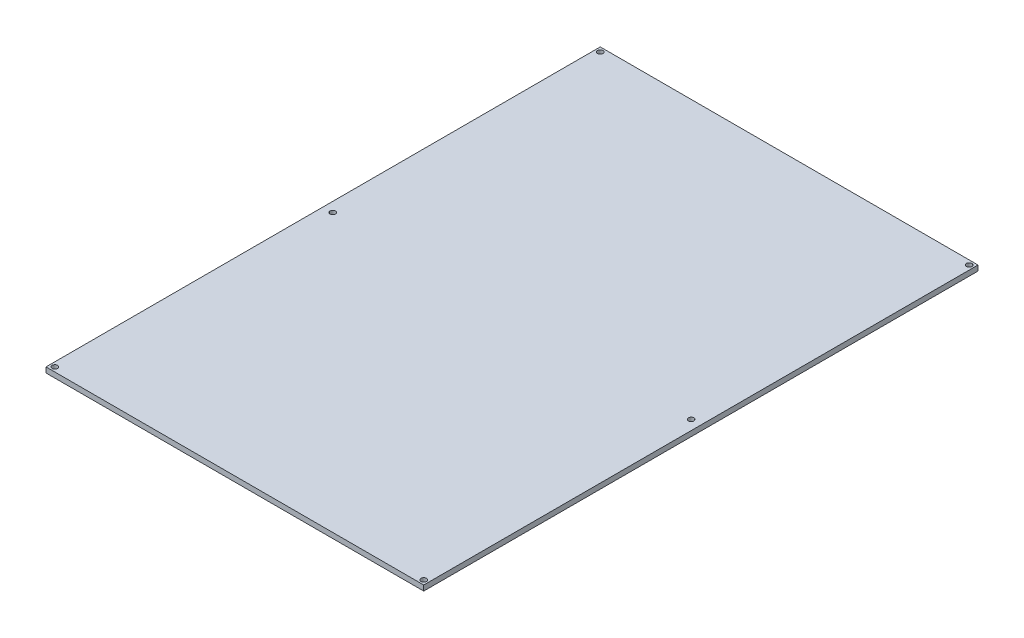
ISO-10303-21;
HEADER;
FILE_DESCRIPTION(('STEP AP214'),'2;1');
FILE_NAME('part.step','',(''),(''),'','','');
FILE_SCHEMA(('AUTOMOTIVE_DESIGN { 1 0 10303 214 1 1 1 1 }'));
ENDSEC;
DATA;
#1=APPLICATION_CONTEXT('core data for automotive mechanical design processes');
#2=APPLICATION_PROTOCOL_DEFINITION('international standard','automotive_design',2000,#1);
#3=PRODUCT_CONTEXT('',#1,'mechanical');
#4=PRODUCT('Part','Part','',(#3));
#5=PRODUCT_RELATED_PRODUCT_CATEGORY('part','',(#4));
#6=PRODUCT_DEFINITION_FORMATION('','',#4);
#7=PRODUCT_DEFINITION_CONTEXT('part definition',#1,'design');
#8=PRODUCT_DEFINITION('design','',#6,#7);
#9=PRODUCT_DEFINITION_SHAPE('','',#8);
#10=(LENGTH_UNIT() NAMED_UNIT(*) SI_UNIT(.MILLI.,.METRE.));
#11=(NAMED_UNIT(*) PLANE_ANGLE_UNIT() SI_UNIT($,.RADIAN.));
#12=(NAMED_UNIT(*) SI_UNIT($,.STERADIAN.) SOLID_ANGLE_UNIT());
#13=UNCERTAINTY_MEASURE_WITH_UNIT(LENGTH_MEASURE(1.E-05),#10,'distance_accuracy_value','');
#14=(GEOMETRIC_REPRESENTATION_CONTEXT(3) GLOBAL_UNCERTAINTY_ASSIGNED_CONTEXT((#13)) GLOBAL_UNIT_ASSIGNED_CONTEXT((#10,
#11,#12)) REPRESENTATION_CONTEXT('',''));
#15=CARTESIAN_POINT('',(0.,0.,0.));
#16=DIRECTION('',(0.,0.,1.));
#17=DIRECTION('',(1.,0.,0.));
#18=AXIS2_PLACEMENT_3D('',#15,#16,#17);
#19=CARTESIAN_POINT('',(0.,3.,0.));
#20=DIRECTION('',(0.,-1.,0.));
#21=DIRECTION('',(0.,0.,-1.));
#22=AXIS2_PLACEMENT_3D('',#19,#20,#21);
#23=PLANE('',#22);
#24=DIRECTION('',(0.,0.,1.));
#25=VECTOR('',#24,1.);
#26=CARTESIAN_POINT('',(0.,3.,0.));
#27=LINE('',#26,#25);
#28=CARTESIAN_POINT('',(-1.11022302462516E-13,3.,-314.));
#29=VERTEX_POINT('',#28);
#30=CARTESIAN_POINT('',(0.,3.,0.));
#31=VERTEX_POINT('',#30);
#32=EDGE_CURVE('E94',#29,#31,#27,.T.);
#33=ORIENTED_EDGE('',*,*,#32,.T.);
#34=DIRECTION('',(1.,0.,0.));
#35=VECTOR('',#34,1.);
#36=CARTESIAN_POINT('',(0.,3.,0.));
#37=LINE('',#36,#35);
#38=CARTESIAN_POINT('',(214.,3.,0.));
#39=VERTEX_POINT('',#38);
#40=EDGE_CURVE('E88',#31,#39,#37,.T.);
#41=ORIENTED_EDGE('',*,*,#40,.T.);
#42=DIRECTION('',(0.,0.,-1.));
#43=VECTOR('',#42,1.);
#44=CARTESIAN_POINT('',(214.,3.,0.));
#45=LINE('',#44,#43);
#46=CARTESIAN_POINT('',(214.,3.,-314.));
#47=VERTEX_POINT('',#46);
#48=EDGE_CURVE('E92',#39,#47,#45,.T.);
#49=ORIENTED_EDGE('',*,*,#48,.T.);
#50=DIRECTION('',(-1.,0.,0.));
#51=VECTOR('',#50,1.);
#52=CARTESIAN_POINT('',(-1.11022302462516E-13,3.,-314.));
#53=LINE('',#52,#51);
#54=EDGE_CURVE('E57',#47,#29,#53,.T.);
#55=ORIENTED_EDGE('',*,*,#54,.T.);
#56=EDGE_LOOP('',(#33,#41,#49,#55));
#57=FACE_BOUND('',#56,.T.);
#58=CARTESIAN_POINT('',(2.5,3.,-311.5));
#59=DIRECTION('',(0.,1.,0.));
#60=DIRECTION('',(0.,0.,1.));
#61=AXIS2_PLACEMENT_3D('',#58,#59,#60);
#62=CIRCLE('',#61,1.55000000000003);
#63=CARTESIAN_POINT('',(2.5,3.,-309.95));
#64=VERTEX_POINT('',#63);
#65=EDGE_CURVE('E114',#64,#64,#62,.T.);
#66=ORIENTED_EDGE('',*,*,#65,.F.);
#67=EDGE_LOOP('',(#66));
#68=FACE_BOUND('',#67,.T.);
#69=CARTESIAN_POINT('',(211.5,3.,-311.5));
#70=DIRECTION('',(0.,1.,0.));
#71=DIRECTION('',(0.,0.,-1.));
#72=AXIS2_PLACEMENT_3D('',#69,#70,#71);
#73=CIRCLE('',#72,1.55);
#74=CARTESIAN_POINT('',(211.5,3.,-313.05));
#75=VERTEX_POINT('',#74);
#76=EDGE_CURVE('E130',#75,#75,#73,.T.);
#77=ORIENTED_EDGE('',*,*,#76,.F.);
#78=EDGE_LOOP('',(#77));
#79=FACE_BOUND('',#78,.T.);
#80=CARTESIAN_POINT('',(2.50000000000009,3.,-2.49999999999998));
#81=DIRECTION('',(0.,1.,0.));
#82=DIRECTION('',(0.,0.,-1.));
#83=AXIS2_PLACEMENT_3D('',#80,#81,#82);
#84=CIRCLE('',#83,1.55000000000001);
#85=CARTESIAN_POINT('',(2.50000000000009,3.,-4.04999999999998));
#86=VERTEX_POINT('',#85);
#87=EDGE_CURVE('E136',#86,#86,#84,.T.);
#88=ORIENTED_EDGE('',*,*,#87,.F.);
#89=EDGE_LOOP('',(#88));
#90=FACE_BOUND('',#89,.T.);
#91=CARTESIAN_POINT('',(211.5,3.,-2.5));
#92=DIRECTION('',(0.,1.,0.));
#93=DIRECTION('',(0.,0.,1.));
#94=AXIS2_PLACEMENT_3D('',#91,#92,#93);
#95=CIRCLE('',#94,1.54999999999999);
#96=CARTESIAN_POINT('',(211.5,3.,-0.950000000000008));
#97=VERTEX_POINT('',#96);
#98=EDGE_CURVE('E142',#97,#97,#95,.T.);
#99=ORIENTED_EDGE('',*,*,#98,.F.);
#100=EDGE_LOOP('',(#99));
#101=FACE_BOUND('',#100,.T.);
#102=CARTESIAN_POINT('',(5.50000000000003,3.,-157.));
#103=DIRECTION('',(0.,1.,0.));
#104=DIRECTION('',(0.,0.,1.));
#105=AXIS2_PLACEMENT_3D('',#102,#103,#104);
#106=CIRCLE('',#105,1.55);
#107=CARTESIAN_POINT('',(5.50000000000003,3.,-155.45));
#108=VERTEX_POINT('',#107);
#109=EDGE_CURVE('E148',#108,#108,#106,.T.);
#110=ORIENTED_EDGE('',*,*,#109,.F.);
#111=EDGE_LOOP('',(#110));
#112=FACE_BOUND('',#111,.T.);
#113=CARTESIAN_POINT('',(208.5,3.,-157.));
#114=DIRECTION('',(0.,1.,0.));
#115=DIRECTION('',(0.,0.,-1.));
#116=AXIS2_PLACEMENT_3D('',#113,#114,#115);
#117=CIRCLE('',#116,1.54999999999999);
#118=CARTESIAN_POINT('',(208.5,3.,-158.55));
#119=VERTEX_POINT('',#118);
#120=EDGE_CURVE('E155',#119,#119,#117,.T.);
#121=ORIENTED_EDGE('',*,*,#120,.F.);
#122=EDGE_LOOP('',(#121));
#123=FACE_BOUND('',#122,.T.);
#124=ADVANCED_FACE('F40',(#57,#68,#79,#90,#101,#112,#123),#23,.F.);
#125=CARTESIAN_POINT('',(0.,0.,0.));
#126=DIRECTION('',(0.,-1.,0.));
#127=DIRECTION('',(0.,0.,-1.));
#128=AXIS2_PLACEMENT_3D('',#125,#126,#127);
#129=PLANE('',#128);
#130=CARTESIAN_POINT('',(5.50000000000003,0.,-157.));
#131=DIRECTION('',(0.,1.,0.));
#132=DIRECTION('',(0.,0.,1.));
#133=AXIS2_PLACEMENT_3D('',#130,#131,#132);
#134=CIRCLE('',#133,1.55);
#135=CARTESIAN_POINT('',(5.50000000000003,0.,-155.45));
#136=VERTEX_POINT('',#135);
#137=EDGE_CURVE('E152',#136,#136,#134,.T.);
#138=ORIENTED_EDGE('',*,*,#137,.T.);
#139=EDGE_LOOP('',(#138));
#140=FACE_BOUND('',#139,.T.);
#141=CARTESIAN_POINT('',(2.50000000000009,0.,-2.49999999999998));
#142=DIRECTION('',(0.,1.,0.));
#143=DIRECTION('',(0.,0.,-1.));
#144=AXIS2_PLACEMENT_3D('',#141,#142,#143);
#145=CIRCLE('',#144,1.55000000000001);
#146=CARTESIAN_POINT('',(2.50000000000009,0.,-4.04999999999998));
#147=VERTEX_POINT('',#146);
#148=EDGE_CURVE('E139',#147,#147,#145,.T.);
#149=ORIENTED_EDGE('',*,*,#148,.T.);
#150=EDGE_LOOP('',(#149));
#151=FACE_BOUND('',#150,.T.);
#152=CARTESIAN_POINT('',(2.5,0.,-311.5));
#153=DIRECTION('',(0.,1.,0.));
#154=DIRECTION('',(0.,0.,1.));
#155=AXIS2_PLACEMENT_3D('',#152,#153,#154);
#156=CIRCLE('',#155,1.55000000000003);
#157=CARTESIAN_POINT('',(2.5,0.,-309.95));
#158=VERTEX_POINT('',#157);
#159=EDGE_CURVE('E127',#158,#158,#156,.T.);
#160=ORIENTED_EDGE('',*,*,#159,.T.);
#161=EDGE_LOOP('',(#160));
#162=FACE_BOUND('',#161,.T.);
#163=DIRECTION('',(0.,0.,1.));
#164=VECTOR('',#163,1.);
#165=CARTESIAN_POINT('',(0.,0.,0.));
#166=LINE('',#165,#164);
#167=CARTESIAN_POINT('',(-1.11022302462516E-13,0.,-314.));
#168=VERTEX_POINT('',#167);
#169=CARTESIAN_POINT('',(0.,0.,0.));
#170=VERTEX_POINT('',#169);
#171=EDGE_CURVE('E111',#168,#170,#166,.T.);
#172=ORIENTED_EDGE('',*,*,#171,.F.);
#173=DIRECTION('',(-1.,0.,0.));
#174=VECTOR('',#173,1.);
#175=CARTESIAN_POINT('',(-1.11022302462516E-13,0.,-314.));
#176=LINE('',#175,#174);
#177=CARTESIAN_POINT('',(214.,0.,-314.));
#178=VERTEX_POINT('',#177);
#179=EDGE_CURVE('E81',#178,#168,#176,.T.);
#180=ORIENTED_EDGE('',*,*,#179,.F.);
#181=DIRECTION('',(0.,0.,-1.));
#182=VECTOR('',#181,1.);
#183=CARTESIAN_POINT('',(214.,0.,0.));
#184=LINE('',#183,#182);
#185=CARTESIAN_POINT('',(214.,0.,0.));
#186=VERTEX_POINT('',#185);
#187=EDGE_CURVE('E75',#186,#178,#184,.T.);
#188=ORIENTED_EDGE('',*,*,#187,.F.);
#189=DIRECTION('',(1.,0.,0.));
#190=VECTOR('',#189,1.);
#191=CARTESIAN_POINT('',(0.,0.,0.));
#192=LINE('',#191,#190);
#193=EDGE_CURVE('E99',#170,#186,#192,.T.);
#194=ORIENTED_EDGE('',*,*,#193,.F.);
#195=EDGE_LOOP('',(#172,#180,#188,#194));
#196=FACE_BOUND('',#195,.T.);
#197=CARTESIAN_POINT('',(211.5,0.,-311.5));
#198=DIRECTION('',(0.,1.,0.));
#199=DIRECTION('',(0.,0.,-1.));
#200=AXIS2_PLACEMENT_3D('',#197,#198,#199);
#201=CIRCLE('',#200,1.55);
#202=CARTESIAN_POINT('',(211.5,0.,-313.05));
#203=VERTEX_POINT('',#202);
#204=EDGE_CURVE('E133',#203,#203,#201,.T.);
#205=ORIENTED_EDGE('',*,*,#204,.T.);
#206=EDGE_LOOP('',(#205));
#207=FACE_BOUND('',#206,.T.);
#208=CARTESIAN_POINT('',(211.5,0.,-2.5));
#209=DIRECTION('',(0.,1.,0.));
#210=DIRECTION('',(0.,0.,1.));
#211=AXIS2_PLACEMENT_3D('',#208,#209,#210);
#212=CIRCLE('',#211,1.54999999999999);
#213=CARTESIAN_POINT('',(211.5,0.,-0.950000000000008));
#214=VERTEX_POINT('',#213);
#215=EDGE_CURVE('E145',#214,#214,#212,.T.);
#216=ORIENTED_EDGE('',*,*,#215,.T.);
#217=EDGE_LOOP('',(#216));
#218=FACE_BOUND('',#217,.T.);
#219=CARTESIAN_POINT('',(208.5,0.,-157.));
#220=DIRECTION('',(0.,1.,0.));
#221=DIRECTION('',(0.,0.,-1.));
#222=AXIS2_PLACEMENT_3D('',#219,#220,#221);
#223=CIRCLE('',#222,1.54999999999999);
#224=CARTESIAN_POINT('',(208.5,0.,-158.55));
#225=VERTEX_POINT('',#224);
#226=EDGE_CURVE('E158',#225,#225,#223,.T.);
#227=ORIENTED_EDGE('',*,*,#226,.T.);
#228=EDGE_LOOP('',(#227));
#229=FACE_BOUND('',#228,.T.);
#230=ADVANCED_FACE('F123',(#140,#151,#162,#196,#207,#218,#229),#129,.T.);
#231=CARTESIAN_POINT('',(0.,3.,0.));
#232=DIRECTION('',(1.,0.,0.));
#233=DIRECTION('',(0.,0.,-1.));
#234=AXIS2_PLACEMENT_3D('',#231,#232,#233);
#235=PLANE('',#234);
#236=ORIENTED_EDGE('',*,*,#171,.T.);
#237=DIRECTION('',(0.,-1.,0.));
#238=VECTOR('',#237,1.);
#239=CARTESIAN_POINT('',(0.,3.,0.));
#240=LINE('',#239,#238);
#241=EDGE_CURVE('E11',#31,#170,#240,.T.);
#242=ORIENTED_EDGE('',*,*,#241,.F.);
#243=ORIENTED_EDGE('',*,*,#32,.F.);
#244=DIRECTION('',(0.,-1.,0.));
#245=VECTOR('',#244,1.);
#246=CARTESIAN_POINT('',(-1.11022302462516E-13,3.,-314.));
#247=LINE('',#246,#245);
#248=EDGE_CURVE('E107',#29,#168,#247,.T.);
#249=ORIENTED_EDGE('',*,*,#248,.T.);
#250=EDGE_LOOP('',(#236,#242,#243,#249));
#251=FACE_BOUND('',#250,.T.);
#252=ADVANCED_FACE('F42',(#251),#235,.F.);
#253=CARTESIAN_POINT('',(0.,3.,0.));
#254=DIRECTION('',(0.,0.,-1.));
#255=DIRECTION('',(-1.,0.,0.));
#256=AXIS2_PLACEMENT_3D('',#253,#254,#255);
#257=PLANE('',#256);
#258=ORIENTED_EDGE('',*,*,#193,.T.);
#259=DIRECTION('',(0.,-1.,0.));
#260=VECTOR('',#259,1.);
#261=CARTESIAN_POINT('',(214.,3.,0.));
#262=LINE('',#261,#260);
#263=EDGE_CURVE('E49',#39,#186,#262,.T.);
#264=ORIENTED_EDGE('',*,*,#263,.F.);
#265=ORIENTED_EDGE('',*,*,#40,.F.);
#266=ORIENTED_EDGE('',*,*,#241,.T.);
#267=EDGE_LOOP('',(#258,#264,#265,#266));
#268=FACE_BOUND('',#267,.T.);
#269=ADVANCED_FACE('F98',(#268),#257,.F.);
#270=CARTESIAN_POINT('',(214.,3.,0.));
#271=DIRECTION('',(-1.,0.,0.));
#272=DIRECTION('',(0.,0.,1.));
#273=AXIS2_PLACEMENT_3D('',#270,#271,#272);
#274=PLANE('',#273);
#275=ORIENTED_EDGE('',*,*,#187,.T.);
#276=DIRECTION('',(0.,-1.,0.));
#277=VECTOR('',#276,1.);
#278=CARTESIAN_POINT('',(214.,3.,-314.));
#279=LINE('',#278,#277);
#280=EDGE_CURVE('E101',#47,#178,#279,.T.);
#281=ORIENTED_EDGE('',*,*,#280,.F.);
#282=ORIENTED_EDGE('',*,*,#48,.F.);
#283=ORIENTED_EDGE('',*,*,#263,.T.);
#284=EDGE_LOOP('',(#275,#281,#282,#283));
#285=FACE_BOUND('',#284,.T.);
#286=ADVANCED_FACE('F102',(#285),#274,.F.);
#287=CARTESIAN_POINT('',(-1.11022302462516E-13,3.,-314.));
#288=DIRECTION('',(0.,0.,1.));
#289=DIRECTION('',(1.,0.,0.));
#290=AXIS2_PLACEMENT_3D('',#287,#288,#289);
#291=PLANE('',#290);
#292=ORIENTED_EDGE('',*,*,#179,.T.);
#293=ORIENTED_EDGE('',*,*,#248,.F.);
#294=ORIENTED_EDGE('',*,*,#54,.F.);
#295=ORIENTED_EDGE('',*,*,#280,.T.);
#296=EDGE_LOOP('',(#292,#293,#294,#295));
#297=FACE_BOUND('',#296,.T.);
#298=ADVANCED_FACE('F120',(#297),#291,.F.);
#299=CARTESIAN_POINT('',(2.5,3.,-311.5));
#300=DIRECTION('',(0.,-1.,0.));
#301=DIRECTION('',(0.,0.,-1.));
#302=AXIS2_PLACEMENT_3D('',#299,#300,#301);
#303=CYLINDRICAL_SURFACE('',#302,1.55000000000003);
#304=ORIENTED_EDGE('',*,*,#65,.T.);
#305=EDGE_LOOP('',(#304));
#306=FACE_BOUND('',#305,.T.);
#307=ORIENTED_EDGE('',*,*,#159,.F.);
#308=EDGE_LOOP('',(#307));
#309=FACE_BOUND('',#308,.T.);
#310=ADVANCED_FACE('F177',(#306,#309),#303,.F.);
#311=CARTESIAN_POINT('',(211.5,3.,-311.5));
#312=DIRECTION('',(0.,-1.,0.));
#313=DIRECTION('',(0.,0.,-1.));
#314=AXIS2_PLACEMENT_3D('',#311,#312,#313);
#315=CYLINDRICAL_SURFACE('',#314,1.55);
#316=ORIENTED_EDGE('',*,*,#76,.T.);
#317=EDGE_LOOP('',(#316));
#318=FACE_BOUND('',#317,.T.);
#319=ORIENTED_EDGE('',*,*,#204,.F.);
#320=EDGE_LOOP('',(#319));
#321=FACE_BOUND('',#320,.T.);
#322=ADVANCED_FACE('F225',(#318,#321),#315,.F.);
#323=CARTESIAN_POINT('',(2.50000000000009,3.,-2.49999999999998));
#324=DIRECTION('',(0.,-1.,0.));
#325=DIRECTION('',(0.,0.,-1.));
#326=AXIS2_PLACEMENT_3D('',#323,#324,#325);
#327=CYLINDRICAL_SURFACE('',#326,1.55000000000001);
#328=ORIENTED_EDGE('',*,*,#87,.T.);
#329=EDGE_LOOP('',(#328));
#330=FACE_BOUND('',#329,.T.);
#331=ORIENTED_EDGE('',*,*,#148,.F.);
#332=EDGE_LOOP('',(#331));
#333=FACE_BOUND('',#332,.T.);
#334=ADVANCED_FACE('F233',(#330,#333),#327,.F.);
#335=CARTESIAN_POINT('',(211.5,3.,-2.5));
#336=DIRECTION('',(0.,-1.,0.));
#337=DIRECTION('',(0.,0.,-1.));
#338=AXIS2_PLACEMENT_3D('',#335,#336,#337);
#339=CYLINDRICAL_SURFACE('',#338,1.54999999999999);
#340=ORIENTED_EDGE('',*,*,#98,.T.);
#341=EDGE_LOOP('',(#340));
#342=FACE_BOUND('',#341,.T.);
#343=ORIENTED_EDGE('',*,*,#215,.F.);
#344=EDGE_LOOP('',(#343));
#345=FACE_BOUND('',#344,.T.);
#346=ADVANCED_FACE('F241',(#342,#345),#339,.F.);
#347=CARTESIAN_POINT('',(5.50000000000003,3.,-157.));
#348=DIRECTION('',(0.,-1.,0.));
#349=DIRECTION('',(0.,0.,-1.));
#350=AXIS2_PLACEMENT_3D('',#347,#348,#349);
#351=CYLINDRICAL_SURFACE('',#350,1.55);
#352=ORIENTED_EDGE('',*,*,#109,.T.);
#353=EDGE_LOOP('',(#352));
#354=FACE_BOUND('',#353,.T.);
#355=ORIENTED_EDGE('',*,*,#137,.F.);
#356=EDGE_LOOP('',(#355));
#357=FACE_BOUND('',#356,.T.);
#358=ADVANCED_FACE('F250',(#354,#357),#351,.F.);
#359=CARTESIAN_POINT('',(208.5,3.,-157.));
#360=DIRECTION('',(0.,-1.,0.));
#361=DIRECTION('',(0.,0.,-1.));
#362=AXIS2_PLACEMENT_3D('',#359,#360,#361);
#363=CYLINDRICAL_SURFACE('',#362,1.54999999999999);
#364=ORIENTED_EDGE('',*,*,#120,.T.);
#365=EDGE_LOOP('',(#364));
#366=FACE_BOUND('',#365,.T.);
#367=ORIENTED_EDGE('',*,*,#226,.F.);
#368=EDGE_LOOP('',(#367));
#369=FACE_BOUND('',#368,.T.);
#370=ADVANCED_FACE('F166',(#366,#369),#363,.F.);
#371=CLOSED_SHELL('',(#124,#230,#252,#269,#286,#298,#310,#322,#334,#346,#358,#370));
#372=MANIFOLD_SOLID_BREP('B2',#371);
#373=ADVANCED_BREP_SHAPE_REPRESENTATION('',(#18,#372),#14);
#374=SHAPE_DEFINITION_REPRESENTATION(#9,#373);
ENDSEC;
END-ISO-10303-21;
